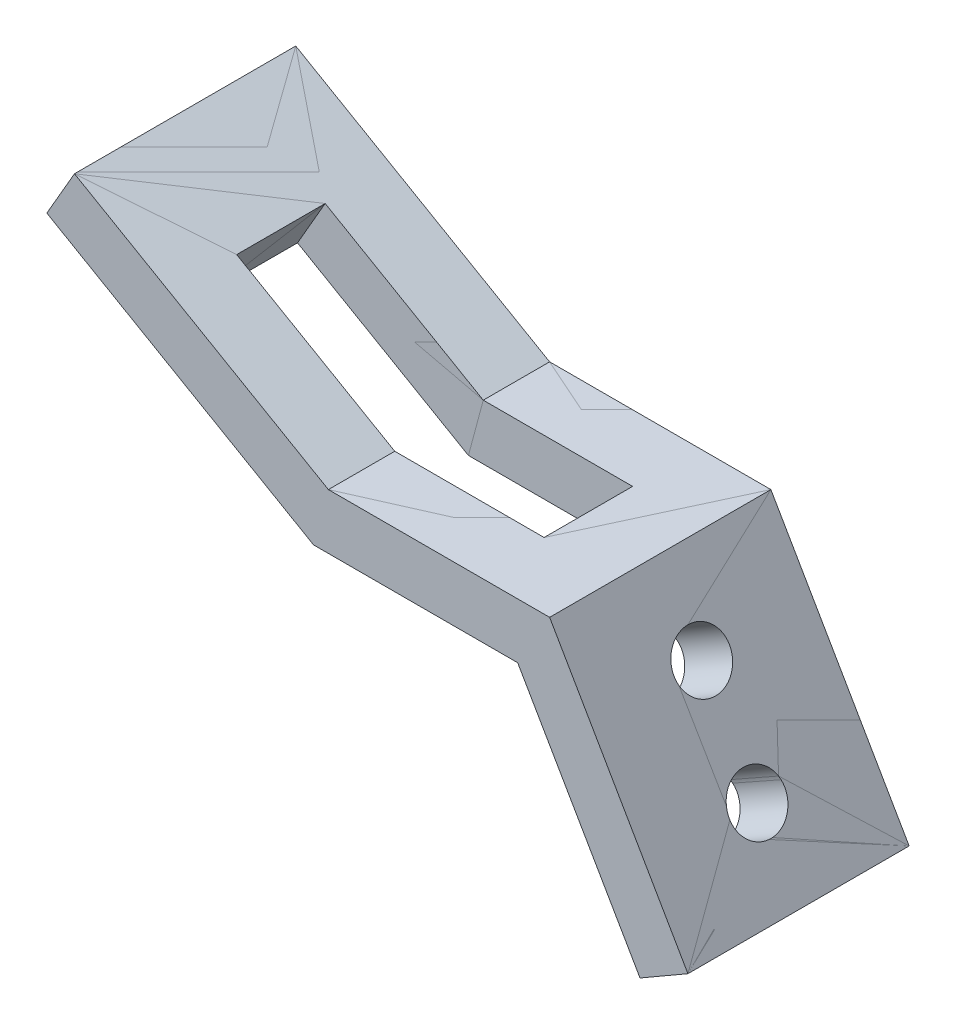
ISO-10303-21;
HEADER;
FILE_DESCRIPTION(('STEP AP214'),'2;1');
FILE_NAME('part.step','',(''),(''),'','','');
FILE_SCHEMA(('AUTOMOTIVE_DESIGN { 1 0 10303 214 1 1 1 1 }'));
ENDSEC;
DATA;
#1=APPLICATION_CONTEXT('core data for automotive mechanical design processes');
#2=APPLICATION_PROTOCOL_DEFINITION('international standard','automotive_design',2000,#1);
#3=PRODUCT_CONTEXT('',#1,'mechanical');
#4=PRODUCT('Part','Part','',(#3));
#5=PRODUCT_RELATED_PRODUCT_CATEGORY('part','',(#4));
#6=PRODUCT_DEFINITION_FORMATION('','',#4);
#7=PRODUCT_DEFINITION_CONTEXT('part definition',#1,'design');
#8=PRODUCT_DEFINITION('design','',#6,#7);
#9=PRODUCT_DEFINITION_SHAPE('','',#8);
#10=(LENGTH_UNIT() NAMED_UNIT(*) SI_UNIT(.MILLI.,.METRE.));
#11=(NAMED_UNIT(*) PLANE_ANGLE_UNIT() SI_UNIT($,.RADIAN.));
#12=(NAMED_UNIT(*) SI_UNIT($,.STERADIAN.) SOLID_ANGLE_UNIT());
#13=UNCERTAINTY_MEASURE_WITH_UNIT(LENGTH_MEASURE(1.E-05),#10,'distance_accuracy_value','');
#14=(GEOMETRIC_REPRESENTATION_CONTEXT(3) GLOBAL_UNCERTAINTY_ASSIGNED_CONTEXT((#13)) GLOBAL_UNIT_ASSIGNED_CONTEXT((#10,
#11,#12)) REPRESENTATION_CONTEXT('',''));
#15=CARTESIAN_POINT('',(0.,0.,0.));
#16=DIRECTION('',(0.,0.,1.));
#17=DIRECTION('',(1.,0.,0.));
#18=AXIS2_PLACEMENT_3D('',#15,#16,#17);
#19=CARTESIAN_POINT('',(2.32050807568877,-1.33974596215561,20.));
#20=DIRECTION('',(-0.5,-0.866025403784439,0.));
#21=DIRECTION('',(0.866025403784439,-0.5,0.));
#22=AXIS2_PLACEMENT_3D('',#19,#20,#21);
#23=PLANE('',#22);
#24=DIRECTION('',(0.,0.,1.));
#25=VECTOR('',#24,1.);
#26=CARTESIAN_POINT('',(-28.5788383248865,16.5,-8.));
#27=LINE('',#26,#25);
#28=CARTESIAN_POINT('',(-28.5788383248865,16.5,-8.));
#29=VERTEX_POINT('',#28);
#30=CARTESIAN_POINT('',(-28.5788383248865,16.5,8.));
#31=VERTEX_POINT('',#30);
#32=EDGE_CURVE('E206',#29,#31,#27,.T.);
#33=ORIENTED_EDGE('',*,*,#32,.F.);
#34=DIRECTION('',(-0.866025403784439,0.5,0.));
#35=VECTOR('',#34,1.);
#36=CARTESIAN_POINT('',(-28.5788383248865,16.5,-8.));
#37=LINE('',#36,#35);
#38=CARTESIAN_POINT('',(0.,0.,-8.));
#39=VERTEX_POINT('',#38);
#40=EDGE_CURVE('E212',#39,#29,#37,.T.);
#41=ORIENTED_EDGE('',*,*,#40,.F.);
#42=DIRECTION('',(0.,0.,-1.));
#43=VECTOR('',#42,1.);
#44=CARTESIAN_POINT('',(0.,0.,20.));
#45=LINE('',#44,#43);
#46=CARTESIAN_POINT('',(0.,0.,-20.));
#47=VERTEX_POINT('',#46);
#48=EDGE_CURVE('E253',#39,#47,#45,.T.);
#49=ORIENTED_EDGE('',*,*,#48,.T.);
#50=DIRECTION('',(-0.866025403784439,0.5,0.));
#51=VECTOR('',#50,1.);
#52=CARTESIAN_POINT('',(2.32050807568877,-1.33974596215561,-20.));
#53=LINE('',#52,#51);
#54=CARTESIAN_POINT('',(-45.8993464005753,26.5,-20.));
#55=VERTEX_POINT('',#54);
#56=EDGE_CURVE('E254',#47,#55,#53,.T.);
#57=ORIENTED_EDGE('',*,*,#56,.T.);
#58=DIRECTION('',(0.,0.,-1.));
#59=VECTOR('',#58,1.);
#60=CARTESIAN_POINT('',(-45.8993464005753,26.5,20.));
#61=LINE('',#60,#59);
#62=CARTESIAN_POINT('',(-45.8993464005753,26.5,20.));
#63=VERTEX_POINT('',#62);
#64=EDGE_CURVE('E13',#63,#55,#61,.T.);
#65=ORIENTED_EDGE('',*,*,#64,.F.);
#66=DIRECTION('',(-0.866025403784439,0.5,0.));
#67=VECTOR('',#66,1.);
#68=CARTESIAN_POINT('',(2.32050807568877,-1.33974596215561,20.));
#69=LINE('',#68,#67);
#70=CARTESIAN_POINT('',(0.,0.,20.));
#71=VERTEX_POINT('',#70);
#72=EDGE_CURVE('E231',#71,#63,#69,.T.);
#73=ORIENTED_EDGE('',*,*,#72,.F.);
#74=CARTESIAN_POINT('',(0.,0.,8.));
#75=VERTEX_POINT('',#74);
#76=EDGE_CURVE('E277',#71,#75,#45,.T.);
#77=ORIENTED_EDGE('',*,*,#76,.T.);
#78=DIRECTION('',(-0.866025403784439,0.5,0.));
#79=VECTOR('',#78,1.);
#80=CARTESIAN_POINT('',(-28.5788383248865,16.5,8.));
#81=LINE('',#80,#79);
#82=EDGE_CURVE('E123',#75,#31,#81,.T.);
#83=ORIENTED_EDGE('',*,*,#82,.T.);
#84=EDGE_LOOP('',(#33,#41,#49,#57,#65,#73,#77,#83));
#85=FACE_BOUND('',#84,.T.);
#86=ADVANCED_FACE('F103',(#85),#23,.F.);
#87=CARTESIAN_POINT('',(-50.8993464005753,17.8397459621556,20.));
#88=DIRECTION('',(-0.866025403784439,0.5,0.));
#89=DIRECTION('',(-0.5,-0.866025403784439,0.));
#90=AXIS2_PLACEMENT_3D('',#87,#88,#89);
#91=PLANE('',#90);
#92=DIRECTION('',(0.5,0.866025403784439,0.));
#93=VECTOR('',#92,1.);
#94=CARTESIAN_POINT('',(-50.8993464005753,17.8397459621556,-20.));
#95=LINE('',#94,#93);
#96=CARTESIAN_POINT('',(-50.8993464005753,17.8397459621556,-20.));
#97=VERTEX_POINT('',#96);
#98=EDGE_CURVE('E257',#97,#55,#95,.T.);
#99=ORIENTED_EDGE('',*,*,#98,.F.);
#100=DIRECTION('',(0.,0.,-1.));
#101=VECTOR('',#100,1.);
#102=CARTESIAN_POINT('',(-50.8993464005753,17.8397459621556,20.));
#103=LINE('',#102,#101);
#104=CARTESIAN_POINT('',(-50.8993464005753,17.8397459621556,20.));
#105=VERTEX_POINT('',#104);
#106=EDGE_CURVE('E110',#105,#97,#103,.T.);
#107=ORIENTED_EDGE('',*,*,#106,.F.);
#108=DIRECTION('',(0.5,0.866025403784439,0.));
#109=VECTOR('',#108,1.);
#110=CARTESIAN_POINT('',(-50.8993464005753,17.8397459621556,20.));
#111=LINE('',#110,#109);
#112=EDGE_CURVE('E233',#105,#63,#111,.T.);
#113=ORIENTED_EDGE('',*,*,#112,.T.);
#114=ORIENTED_EDGE('',*,*,#64,.T.);
#115=EDGE_LOOP('',(#99,#107,#113,#114));
#116=FACE_BOUND('',#115,.T.);
#117=ADVANCED_FACE('F299',(#116),#91,.T.);
#118=CARTESIAN_POINT('',(-2.67949192431123,-10.,20.));
#119=DIRECTION('',(-0.5,-0.866025403784439,0.));
#120=DIRECTION('',(0.866025403784439,-0.5,0.));
#121=AXIS2_PLACEMENT_3D('',#118,#119,#120);
#122=PLANE('',#121);
#123=DIRECTION('',(0.866025403784439,-0.5,0.));
#124=VECTOR('',#123,1.);
#125=CARTESIAN_POINT('',(-2.67949192431123,-10.,-8.));
#126=LINE('',#125,#124);
#127=CARTESIAN_POINT('',(-33.5788383248865,7.83974596215562,-8.));
#128=VERTEX_POINT('',#127);
#129=CARTESIAN_POINT('',(-2.67949192431123,-10.,-8.));
#130=VERTEX_POINT('',#129);
#131=EDGE_CURVE('E211',#128,#130,#126,.T.);
#132=ORIENTED_EDGE('',*,*,#131,.F.);
#133=DIRECTION('',(0.,0.,1.));
#134=VECTOR('',#133,1.);
#135=CARTESIAN_POINT('',(-33.5788383248865,7.83974596215562,-8.));
#136=LINE('',#135,#134);
#137=CARTESIAN_POINT('',(-33.5788383248865,7.83974596215562,8.));
#138=VERTEX_POINT('',#137);
#139=EDGE_CURVE('E208',#128,#138,#136,.T.);
#140=ORIENTED_EDGE('',*,*,#139,.T.);
#141=DIRECTION('',(0.866025403784439,-0.5,0.));
#142=VECTOR('',#141,1.);
#143=CARTESIAN_POINT('',(-2.67949192431123,-10.,8.));
#144=LINE('',#143,#142);
#145=CARTESIAN_POINT('',(-2.67949192431123,-10.,8.));
#146=VERTEX_POINT('',#145);
#147=EDGE_CURVE('E322',#138,#146,#144,.T.);
#148=ORIENTED_EDGE('',*,*,#147,.T.);
#149=DIRECTION('',(0.,0.,-1.));
#150=VECTOR('',#149,1.);
#151=CARTESIAN_POINT('',(-2.67949192431123,-10.,20.));
#152=LINE('',#151,#150);
#153=CARTESIAN_POINT('',(-2.67949192431123,-10.,20.));
#154=VERTEX_POINT('',#153);
#155=EDGE_CURVE('E289',#154,#146,#152,.T.);
#156=ORIENTED_EDGE('',*,*,#155,.F.);
#157=DIRECTION('',(-0.866025403784438,0.5,0.));
#158=VECTOR('',#157,1.);
#159=CARTESIAN_POINT('',(-2.67949192431123,-10.,20.));
#160=LINE('',#159,#158);
#161=EDGE_CURVE('E237',#154,#105,#160,.T.);
#162=ORIENTED_EDGE('',*,*,#161,.T.);
#163=ORIENTED_EDGE('',*,*,#106,.T.);
#164=DIRECTION('',(-0.866025403784438,0.5,0.));
#165=VECTOR('',#164,1.);
#166=CARTESIAN_POINT('',(-2.67949192431123,-10.,-20.));
#167=LINE('',#166,#165);
#168=CARTESIAN_POINT('',(-2.67949192431123,-10.,-20.));
#169=VERTEX_POINT('',#168);
#170=EDGE_CURVE('E261',#169,#97,#167,.T.);
#171=ORIENTED_EDGE('',*,*,#170,.F.);
#172=EDGE_CURVE('E288',#130,#169,#152,.T.);
#173=ORIENTED_EDGE('',*,*,#172,.F.);
#174=EDGE_LOOP('',(#132,#140,#148,#156,#162,#163,#171,#173));
#175=FACE_BOUND('',#174,.T.);
#176=ADVANCED_FACE('F294',(#175),#122,.T.);
#177=CARTESIAN_POINT('',(-2.67949192431123,-10.,20.));
#178=DIRECTION('',(0.,-1.,0.));
#179=DIRECTION('',(0.,0.,-1.));
#180=AXIS2_PLACEMENT_3D('',#177,#178,#179);
#181=PLANE('',#180);
#182=DIRECTION('',(1.,0.,0.));
#183=VECTOR('',#182,1.);
#184=CARTESIAN_POINT('',(27.,-10.,-8.));
#185=LINE('',#184,#183);
#186=CARTESIAN_POINT('',(27.,-10.,-8.));
#187=VERTEX_POINT('',#186);
#188=EDGE_CURVE('E312',#130,#187,#185,.T.);
#189=ORIENTED_EDGE('',*,*,#188,.F.);
#190=ORIENTED_EDGE('',*,*,#172,.T.);
#191=DIRECTION('',(-1.,0.,0.));
#192=VECTOR('',#191,1.);
#193=CARTESIAN_POINT('',(-2.67949192431123,-10.,-20.));
#194=LINE('',#193,#192);
#195=CARTESIAN_POINT('',(34.2264973081037,-10.,-20.));
#196=VERTEX_POINT('',#195);
#197=EDGE_CURVE('E264',#196,#169,#194,.T.);
#198=ORIENTED_EDGE('',*,*,#197,.F.);
#199=DIRECTION('',(0.,0.,-1.));
#200=VECTOR('',#199,1.);
#201=CARTESIAN_POINT('',(34.2264973081037,-10.,20.));
#202=LINE('',#201,#200);
#203=CARTESIAN_POINT('',(34.2264973081037,-10.,20.));
#204=VERTEX_POINT('',#203);
#205=EDGE_CURVE('E286',#204,#196,#202,.T.);
#206=ORIENTED_EDGE('',*,*,#205,.F.);
#207=DIRECTION('',(-1.,0.,0.));
#208=VECTOR('',#207,1.);
#209=CARTESIAN_POINT('',(-2.67949192431123,-10.,20.));
#210=LINE('',#209,#208);
#211=EDGE_CURVE('E240',#204,#154,#210,.T.);
#212=ORIENTED_EDGE('',*,*,#211,.T.);
#213=ORIENTED_EDGE('',*,*,#155,.T.);
#214=DIRECTION('',(1.,0.,0.));
#215=VECTOR('',#214,1.);
#216=CARTESIAN_POINT('',(27.,-10.,8.));
#217=LINE('',#216,#215);
#218=CARTESIAN_POINT('',(27.,-10.,8.));
#219=VERTEX_POINT('',#218);
#220=EDGE_CURVE('E324',#146,#219,#217,.T.);
#221=ORIENTED_EDGE('',*,*,#220,.T.);
#222=DIRECTION('',(0.,0.,1.));
#223=VECTOR('',#222,1.);
#224=CARTESIAN_POINT('',(27.,-10.,-8.));
#225=LINE('',#224,#223);
#226=EDGE_CURVE('E225',#187,#219,#225,.T.);
#227=ORIENTED_EDGE('',*,*,#226,.F.);
#228=EDGE_LOOP('',(#189,#190,#198,#206,#212,#213,#221,#227));
#229=FACE_BOUND('',#228,.T.);
#230=ADVANCED_FACE('F308',(#229),#181,.T.);
#231=CARTESIAN_POINT('',(34.2264973081037,-10.,20.));
#232=DIRECTION('',(-0.866025403784439,-0.5,0.));
#233=DIRECTION('',(0.5,-0.866025403784439,0.));
#234=AXIS2_PLACEMENT_3D('',#231,#232,#233);
#235=PLANE('',#234);
#236=CARTESIAN_POINT('',(38.8397459621556,-17.9903810567666,0.));
#237=DIRECTION('',(-0.866025403784439,-0.5,0.));
#238=DIRECTION('',(0.5,-0.866025403784439,0.));
#239=AXIS2_PLACEMENT_3D('',#236,#237,#238);
#240=CIRCLE('',#239,5.);
#241=CARTESIAN_POINT('',(41.3397459621556,-22.3205080756888,0.));
#242=VERTEX_POINT('',#241);
#243=EDGE_CURVE('E320',#242,#242,#240,.T.);
#244=ORIENTED_EDGE('',*,*,#243,.F.);
#245=EDGE_LOOP('',(#244));
#246=FACE_BOUND('',#245,.T.);
#247=CARTESIAN_POINT('',(48.8397459621556,-35.3108891324554,0.));
#248=DIRECTION('',(-0.866025403784439,-0.5,0.));
#249=DIRECTION('',(0.5,-0.866025403784439,0.));
#250=AXIS2_PLACEMENT_3D('',#247,#248,#249);
#251=CIRCLE('',#250,5.);
#252=CARTESIAN_POINT('',(51.3397459621556,-39.6410161513776,0.));
#253=VERTEX_POINT('',#252);
#254=EDGE_CURVE('E492',#253,#253,#251,.T.);
#255=ORIENTED_EDGE('',*,*,#254,.F.);
#256=EDGE_LOOP('',(#255));
#257=FACE_BOUND('',#256,.T.);
#258=DIRECTION('',(-0.5,0.866025403784439,0.));
#259=VECTOR('',#258,1.);
#260=CARTESIAN_POINT('',(34.2264973081037,-10.,-20.));
#261=LINE('',#260,#259);
#262=CARTESIAN_POINT('',(56.3397459621556,-48.3012701892219,-20.));
#263=VERTEX_POINT('',#262);
#264=EDGE_CURVE('E267',#263,#196,#261,.T.);
#265=ORIENTED_EDGE('',*,*,#264,.F.);
#266=DIRECTION('',(0.,0.,-1.));
#267=VECTOR('',#266,1.);
#268=CARTESIAN_POINT('',(56.3397459621556,-48.3012701892219,20.));
#269=LINE('',#268,#267);
#270=CARTESIAN_POINT('',(56.3397459621556,-48.3012701892219,20.));
#271=VERTEX_POINT('',#270);
#272=EDGE_CURVE('E284',#271,#263,#269,.T.);
#273=ORIENTED_EDGE('',*,*,#272,.F.);
#274=DIRECTION('',(-0.5,0.866025403784439,0.));
#275=VECTOR('',#274,1.);
#276=CARTESIAN_POINT('',(34.2264973081037,-10.,20.));
#277=LINE('',#276,#275);
#278=EDGE_CURVE('E243',#271,#204,#277,.T.);
#279=ORIENTED_EDGE('',*,*,#278,.T.);
#280=ORIENTED_EDGE('',*,*,#205,.T.);
#281=EDGE_LOOP('',(#265,#273,#279,#280));
#282=FACE_BOUND('',#281,.T.);
#283=ADVANCED_FACE('F352',(#246,#257,#282),#235,.T.);
#284=CARTESIAN_POINT('',(65.,-43.3012701892219,20.));
#285=DIRECTION('',(0.499999999999999,-0.866025403784439,0.));
#286=DIRECTION('',(0.866025403784439,0.499999999999999,0.));
#287=AXIS2_PLACEMENT_3D('',#284,#285,#286);
#288=PLANE('',#287);
#289=DIRECTION('',(-0.866025403784439,-0.499999999999999,0.));
#290=VECTOR('',#289,1.);
#291=CARTESIAN_POINT('',(65.,-43.3012701892219,-20.));
#292=LINE('',#291,#290);
#293=CARTESIAN_POINT('',(65.,-43.3012701892219,-20.));
#294=VERTEX_POINT('',#293);
#295=EDGE_CURVE('E270',#294,#263,#292,.T.);
#296=ORIENTED_EDGE('',*,*,#295,.F.);
#297=DIRECTION('',(0.,0.,-1.));
#298=VECTOR('',#297,1.);
#299=CARTESIAN_POINT('',(65.,-43.3012701892219,20.));
#300=LINE('',#299,#298);
#301=CARTESIAN_POINT('',(65.,-43.3012701892219,20.));
#302=VERTEX_POINT('',#301);
#303=EDGE_CURVE('E282',#302,#294,#300,.T.);
#304=ORIENTED_EDGE('',*,*,#303,.F.);
#305=DIRECTION('',(-0.866025403784439,-0.499999999999999,0.));
#306=VECTOR('',#305,1.);
#307=CARTESIAN_POINT('',(65.,-43.3012701892219,20.));
#308=LINE('',#307,#306);
#309=EDGE_CURVE('E246',#302,#271,#308,.T.);
#310=ORIENTED_EDGE('',*,*,#309,.T.);
#311=ORIENTED_EDGE('',*,*,#272,.T.);
#312=EDGE_LOOP('',(#296,#304,#310,#311));
#313=FACE_BOUND('',#312,.T.);
#314=ADVANCED_FACE('F350',(#313),#288,.T.);
#315=CARTESIAN_POINT('',(42.8867513459481,-5.,20.));
#316=DIRECTION('',(-0.866025403784439,-0.5,0.));
#317=DIRECTION('',(0.5,-0.866025403784439,0.));
#318=AXIS2_PLACEMENT_3D('',#315,#316,#317);
#319=PLANE('',#318);
#320=CARTESIAN_POINT('',(47.5,-12.9903810567666,0.));
#321=DIRECTION('',(0.866025403784438,0.500000000000002,0.));
#322=DIRECTION('',(-0.500000000000001,0.866025403784438,0.));
#323=AXIS2_PLACEMENT_3D('',#320,#321,#322);
#324=CIRCLE('',#323,5.);
#325=CARTESIAN_POINT('',(45.,-8.66025403784441,0.));
#326=VERTEX_POINT('',#325);
#327=EDGE_CURVE('E491',#326,#326,#324,.T.);
#328=ORIENTED_EDGE('',*,*,#327,.F.);
#329=EDGE_LOOP('',(#328));
#330=FACE_BOUND('',#329,.T.);
#331=CARTESIAN_POINT('',(57.5000000000001,-30.3108891324554,0.));
#332=DIRECTION('',(0.866025403784438,0.500000000000002,0.));
#333=DIRECTION('',(-0.500000000000001,0.866025403784438,0.));
#334=AXIS2_PLACEMENT_3D('',#331,#332,#333);
#335=CIRCLE('',#334,5.);
#336=CARTESIAN_POINT('',(55.,-25.9807621135332,0.));
#337=VERTEX_POINT('',#336);
#338=EDGE_CURVE('E493',#337,#337,#335,.T.);
#339=ORIENTED_EDGE('',*,*,#338,.F.);
#340=EDGE_LOOP('',(#339));
#341=FACE_BOUND('',#340,.T.);
#342=DIRECTION('',(-0.5,0.866025403784439,0.));
#343=VECTOR('',#342,1.);
#344=CARTESIAN_POINT('',(42.8867513459481,-5.,-20.));
#345=LINE('',#344,#343);
#346=CARTESIAN_POINT('',(40.,0.,-20.));
#347=VERTEX_POINT('',#346);
#348=EDGE_CURVE('E273',#294,#347,#345,.T.);
#349=ORIENTED_EDGE('',*,*,#348,.T.);
#350=DIRECTION('',(0.,0.,-1.));
#351=VECTOR('',#350,1.);
#352=CARTESIAN_POINT('',(40.,0.,20.));
#353=LINE('',#352,#351);
#354=CARTESIAN_POINT('',(40.,0.,20.));
#355=VERTEX_POINT('',#354);
#356=EDGE_CURVE('E279',#355,#347,#353,.T.);
#357=ORIENTED_EDGE('',*,*,#356,.F.);
#358=DIRECTION('',(-0.5,0.866025403784439,0.));
#359=VECTOR('',#358,1.);
#360=CARTESIAN_POINT('',(42.8867513459481,-5.,20.));
#361=LINE('',#360,#359);
#362=EDGE_CURVE('E249',#302,#355,#361,.T.);
#363=ORIENTED_EDGE('',*,*,#362,.F.);
#364=ORIENTED_EDGE('',*,*,#303,.T.);
#365=EDGE_LOOP('',(#349,#357,#363,#364));
#366=FACE_BOUND('',#365,.T.);
#367=ADVANCED_FACE('F347',(#330,#341,#366),#319,.F.);
#368=CARTESIAN_POINT('',(-2.67949192431123,0.,20.));
#369=DIRECTION('',(0.,-1.,0.));
#370=DIRECTION('',(0.,0.,-1.));
#371=AXIS2_PLACEMENT_3D('',#368,#369,#370);
#372=PLANE('',#371);
#373=ORIENTED_EDGE('',*,*,#48,.F.);
#374=DIRECTION('',(-1.,0.,0.));
#375=VECTOR('',#374,1.);
#376=CARTESIAN_POINT('',(0.,0.,-8.));
#377=LINE('',#376,#375);
#378=CARTESIAN_POINT('',(27.,0.,-8.));
#379=VERTEX_POINT('',#378);
#380=EDGE_CURVE('E218',#379,#39,#377,.T.);
#381=ORIENTED_EDGE('',*,*,#380,.F.);
#382=DIRECTION('',(0.,0.,1.));
#383=VECTOR('',#382,1.);
#384=CARTESIAN_POINT('',(27.,0.,-8.));
#385=LINE('',#384,#383);
#386=CARTESIAN_POINT('',(27.,0.,8.));
#387=VERTEX_POINT('',#386);
#388=EDGE_CURVE('E258',#379,#387,#385,.T.);
#389=ORIENTED_EDGE('',*,*,#388,.T.);
#390=DIRECTION('',(-1.,0.,0.));
#391=VECTOR('',#390,1.);
#392=CARTESIAN_POINT('',(0.,0.,8.));
#393=LINE('',#392,#391);
#394=EDGE_CURVE('E221',#387,#75,#393,.T.);
#395=ORIENTED_EDGE('',*,*,#394,.T.);
#396=ORIENTED_EDGE('',*,*,#76,.F.);
#397=DIRECTION('',(1.,0.,0.));
#398=VECTOR('',#397,1.);
#399=CARTESIAN_POINT('',(-2.67949192431123,0.,20.));
#400=LINE('',#399,#398);
#401=EDGE_CURVE('E251',#355,#71,#400,.F.);
#402=ORIENTED_EDGE('',*,*,#401,.F.);
#403=ORIENTED_EDGE('',*,*,#356,.T.);
#404=DIRECTION('',(1.,0.,0.));
#405=VECTOR('',#404,1.);
#406=CARTESIAN_POINT('',(-2.67949192431123,0.,-20.));
#407=LINE('',#406,#405);
#408=EDGE_CURVE('E234',#347,#47,#407,.F.);
#409=ORIENTED_EDGE('',*,*,#408,.T.);
#410=EDGE_LOOP('',(#373,#381,#389,#395,#396,#402,#403,#409));
#411=FACE_BOUND('',#410,.T.);
#412=ADVANCED_FACE('F343',(#411),#372,.F.);
#413=CARTESIAN_POINT('',(0.,0.,20.));
#414=DIRECTION('',(0.,0.,-1.));
#415=DIRECTION('',(-1.,0.,0.));
#416=AXIS2_PLACEMENT_3D('',#413,#414,#415);
#417=PLANE('',#416);
#418=ORIENTED_EDGE('',*,*,#72,.T.);
#419=ORIENTED_EDGE('',*,*,#112,.F.);
#420=ORIENTED_EDGE('',*,*,#161,.F.);
#421=ORIENTED_EDGE('',*,*,#211,.F.);
#422=ORIENTED_EDGE('',*,*,#278,.F.);
#423=ORIENTED_EDGE('',*,*,#309,.F.);
#424=ORIENTED_EDGE('',*,*,#362,.T.);
#425=ORIENTED_EDGE('',*,*,#401,.T.);
#426=EDGE_LOOP('',(#418,#419,#420,#421,#422,#423,#424,#425));
#427=FACE_BOUND('',#426,.T.);
#428=ADVANCED_FACE('F334',(#427),#417,.F.);
#429=CARTESIAN_POINT('',(0.,0.,-20.));
#430=DIRECTION('',(0.,0.,-1.));
#431=DIRECTION('',(-1.,0.,0.));
#432=AXIS2_PLACEMENT_3D('',#429,#430,#431);
#433=PLANE('',#432);
#434=ORIENTED_EDGE('',*,*,#56,.F.);
#435=ORIENTED_EDGE('',*,*,#408,.F.);
#436=ORIENTED_EDGE('',*,*,#348,.F.);
#437=ORIENTED_EDGE('',*,*,#295,.T.);
#438=ORIENTED_EDGE('',*,*,#264,.T.);
#439=ORIENTED_EDGE('',*,*,#197,.T.);
#440=ORIENTED_EDGE('',*,*,#170,.T.);
#441=ORIENTED_EDGE('',*,*,#98,.T.);
#442=EDGE_LOOP('',(#434,#435,#436,#437,#438,#439,#440,#441));
#443=FACE_BOUND('',#442,.T.);
#444=ADVANCED_FACE('F303',(#443),#433,.T.);
#445=CARTESIAN_POINT('',(27.,0.,-8.));
#446=DIRECTION('',(1.,0.,0.));
#447=DIRECTION('',(0.,0.,-1.));
#448=AXIS2_PLACEMENT_3D('',#445,#446,#447);
#449=PLANE('',#448);
#450=DIRECTION('',(0.,1.,0.));
#451=VECTOR('',#450,1.);
#452=CARTESIAN_POINT('',(27.,0.,8.));
#453=LINE('',#452,#451);
#454=EDGE_CURVE('E117',#219,#387,#453,.T.);
#455=ORIENTED_EDGE('',*,*,#454,.T.);
#456=ORIENTED_EDGE('',*,*,#388,.F.);
#457=DIRECTION('',(0.,1.,0.));
#458=VECTOR('',#457,1.);
#459=CARTESIAN_POINT('',(27.,0.,-8.));
#460=LINE('',#459,#458);
#461=EDGE_CURVE('E227',#187,#379,#460,.T.);
#462=ORIENTED_EDGE('',*,*,#461,.F.);
#463=ORIENTED_EDGE('',*,*,#226,.T.);
#464=EDGE_LOOP('',(#455,#456,#462,#463));
#465=FACE_BOUND('',#464,.T.);
#466=ADVANCED_FACE('F331',(#465),#449,.F.);
#467=CARTESIAN_POINT('',(-28.5788383248865,16.5,-8.));
#468=DIRECTION('',(-0.866025403784439,0.5,0.));
#469=DIRECTION('',(-0.5,-0.866025403784439,0.));
#470=AXIS2_PLACEMENT_3D('',#467,#468,#469);
#471=PLANE('',#470);
#472=DIRECTION('',(-0.5,-0.866025403784439,0.));
#473=VECTOR('',#472,1.);
#474=CARTESIAN_POINT('',(-28.5788383248865,16.5,8.));
#475=LINE('',#474,#473);
#476=EDGE_CURVE('E319',#31,#138,#475,.T.);
#477=ORIENTED_EDGE('',*,*,#476,.T.);
#478=ORIENTED_EDGE('',*,*,#139,.F.);
#479=DIRECTION('',(-0.5,-0.866025403784439,0.));
#480=VECTOR('',#479,1.);
#481=CARTESIAN_POINT('',(-28.5788383248865,16.5,-8.));
#482=LINE('',#481,#480);
#483=EDGE_CURVE('E201',#29,#128,#482,.T.);
#484=ORIENTED_EDGE('',*,*,#483,.F.);
#485=ORIENTED_EDGE('',*,*,#32,.T.);
#486=EDGE_LOOP('',(#477,#478,#484,#485));
#487=FACE_BOUND('',#486,.T.);
#488=ADVANCED_FACE('F204',(#487),#471,.F.);
#489=CARTESIAN_POINT('',(0.,0.,-8.));
#490=DIRECTION('',(0.,0.,-1.));
#491=DIRECTION('',(-1.,0.,0.));
#492=AXIS2_PLACEMENT_3D('',#489,#490,#491);
#493=PLANE('',#492);
#494=ORIENTED_EDGE('',*,*,#40,.T.);
#495=ORIENTED_EDGE('',*,*,#483,.T.);
#496=ORIENTED_EDGE('',*,*,#131,.T.);
#497=ORIENTED_EDGE('',*,*,#188,.T.);
#498=ORIENTED_EDGE('',*,*,#461,.T.);
#499=ORIENTED_EDGE('',*,*,#380,.T.);
#500=EDGE_LOOP('',(#494,#495,#496,#497,#498,#499));
#501=FACE_BOUND('',#500,.T.);
#502=ADVANCED_FACE('F215',(#501),#493,.F.);
#503=CARTESIAN_POINT('',(0.,0.,8.));
#504=DIRECTION('',(0.,0.,-1.));
#505=DIRECTION('',(-1.,0.,0.));
#506=AXIS2_PLACEMENT_3D('',#503,#504,#505);
#507=PLANE('',#506);
#508=ORIENTED_EDGE('',*,*,#82,.F.);
#509=ORIENTED_EDGE('',*,*,#394,.F.);
#510=ORIENTED_EDGE('',*,*,#454,.F.);
#511=ORIENTED_EDGE('',*,*,#220,.F.);
#512=ORIENTED_EDGE('',*,*,#147,.F.);
#513=ORIENTED_EDGE('',*,*,#476,.F.);
#514=EDGE_LOOP('',(#508,#509,#510,#511,#512,#513));
#515=FACE_BOUND('',#514,.T.);
#516=ADVANCED_FACE('F332',(#515),#507,.T.);
#517=CARTESIAN_POINT('',(-31.5895733098924,-81.7467782649109,0.));
#518=DIRECTION('',(0.866025403784438,0.500000000000001,0.));
#519=DIRECTION('',(-0.500000000000002,0.866025403784438,0.));
#520=AXIS2_PLACEMENT_3D('',#517,#518,#519);
#521=CYLINDRICAL_SURFACE('',#520,5.);
#522=ORIENTED_EDGE('',*,*,#254,.T.);
#523=EDGE_LOOP('',(#522));
#524=FACE_BOUND('',#523,.T.);
#525=ORIENTED_EDGE('',*,*,#338,.T.);
#526=EDGE_LOOP('',(#525));
#527=FACE_BOUND('',#526,.T.);
#528=ADVANCED_FACE('F425',(#524,#527),#521,.F.);
#529=CARTESIAN_POINT('',(-41.5895733098924,-64.4262701892221,0.));
#530=DIRECTION('',(0.866025403784438,0.500000000000001,0.));
#531=DIRECTION('',(-0.500000000000002,0.866025403784438,0.));
#532=AXIS2_PLACEMENT_3D('',#529,#530,#531);
#533=CYLINDRICAL_SURFACE('',#532,5.);
#534=ORIENTED_EDGE('',*,*,#243,.T.);
#535=EDGE_LOOP('',(#534));
#536=FACE_BOUND('',#535,.T.);
#537=ORIENTED_EDGE('',*,*,#327,.T.);
#538=EDGE_LOOP('',(#537));
#539=FACE_BOUND('',#538,.T.);
#540=ADVANCED_FACE('F446',(#536,#539),#533,.F.);
#541=CLOSED_SHELL('',(#86,#117,#176,#230,#283,#314,#367,#412,#428,#444,#466,#488,#502,#516,#528,#540));
#542=MANIFOLD_SOLID_BREP('B2',#541);
#543=CARTESIAN_POINT('',(56.3397459621557,-48.3012701892219,20.));
#544=DIRECTION('',(-0.866025403784437,-0.500000000000002,0.));
#545=DIRECTION('',(0.500000000000002,-0.866025403784437,0.));
#546=AXIS2_PLACEMENT_3D('',#543,#544,#545);
#547=PLANE('',#546);
#548=CARTESIAN_POINT('',(38.8397459621556,-17.9903810567666,0.));
#549=DIRECTION('',(-0.866025403784437,-0.500000000000002,0.));
#550=DIRECTION('',(0.500000000000002,-0.866025403784437,0.));
#551=AXIS2_PLACEMENT_3D('',#548,#549,#550);
#552=CIRCLE('',#551,5.);
#553=CARTESIAN_POINT('',(41.3397459621557,-22.3205080756888,0.));
#554=VERTEX_POINT('',#553);
#555=EDGE_CURVE('E789',#554,#554,#552,.T.);
#556=ORIENTED_EDGE('',*,*,#555,.F.);
#557=EDGE_LOOP('',(#556));
#558=FACE_BOUND('',#557,.T.);
#559=CARTESIAN_POINT('',(48.8397459621557,-35.3108891324554,0.));
#560=DIRECTION('',(-0.866025403784437,-0.500000000000002,0.));
#561=DIRECTION('',(0.500000000000002,-0.866025403784437,0.));
#562=AXIS2_PLACEMENT_3D('',#559,#560,#561);
#563=CIRCLE('',#562,5.);
#564=CARTESIAN_POINT('',(51.3397459621557,-39.6410161513776,0.));
#565=VERTEX_POINT('',#564);
#566=EDGE_CURVE('E800',#565,#565,#563,.T.);
#567=ORIENTED_EDGE('',*,*,#566,.F.);
#568=EDGE_LOOP('',(#567));
#569=FACE_BOUND('',#568,.T.);
#570=DIRECTION('',(-0.500000000000002,0.866025403784437,0.));
#571=VECTOR('',#570,1.);
#572=CARTESIAN_POINT('',(56.3397459621557,-48.3012701892219,-20.));
#573=LINE('',#572,#571);
#574=CARTESIAN_POINT('',(56.3397459621557,-48.3012701892219,-20.));
#575=VERTEX_POINT('',#574);
#576=CARTESIAN_POINT('',(34.2264973081038,-10.,-20.));
#577=VERTEX_POINT('',#576);
#578=EDGE_CURVE('E674',#575,#577,#573,.T.);
#579=ORIENTED_EDGE('',*,*,#578,.F.);
#580=DIRECTION('',(0.,0.,-1.));
#581=VECTOR('',#580,1.);
#582=CARTESIAN_POINT('',(56.3397459621557,-48.3012701892219,20.));
#583=LINE('',#582,#581);
#584=CARTESIAN_POINT('',(56.3397459621557,-48.3012701892219,20.));
#585=VERTEX_POINT('',#584);
#586=EDGE_CURVE('E101',#585,#575,#583,.T.);
#587=ORIENTED_EDGE('',*,*,#586,.F.);
#588=DIRECTION('',(0.500000000000001,-0.866025403784438,0.));
#589=VECTOR('',#588,1.);
#590=CARTESIAN_POINT('',(31.3397459621556,-5.00000000000002,20.));
#591=LINE('',#590,#589);
#592=CARTESIAN_POINT('',(34.2264973081038,-10.,20.));
#593=VERTEX_POINT('',#592);
#594=EDGE_CURVE('E642',#593,#585,#591,.T.);
#595=ORIENTED_EDGE('',*,*,#594,.F.);
#596=DIRECTION('',(0.,0.,-1.));
#597=VECTOR('',#596,1.);
#598=CARTESIAN_POINT('',(34.2264973081038,-10.,20.));
#599=LINE('',#598,#597);
#600=EDGE_CURVE('E673',#593,#577,#599,.T.);
#601=ORIENTED_EDGE('',*,*,#600,.T.);
#602=EDGE_LOOP('',(#579,#587,#595,#601));
#603=FACE_BOUND('',#602,.T.);
#604=ADVANCED_FACE('F507',(#558,#569,#603),#547,.T.);
#605=CARTESIAN_POINT('',(65.0000000000001,-43.3012701892219,20.));
#606=DIRECTION('',(0.500000000000001,-0.866025403784438,0.));
#607=DIRECTION('',(0.866025403784438,0.500000000000001,0.));
#608=AXIS2_PLACEMENT_3D('',#605,#606,#607);
#609=PLANE('',#608);
#610=DIRECTION('',(-0.866025403784438,-0.500000000000001,0.));
#611=VECTOR('',#610,1.);
#612=CARTESIAN_POINT('',(65.0000000000001,-43.3012701892219,-20.));
#613=LINE('',#612,#611);
#614=CARTESIAN_POINT('',(65.0000000000001,-43.3012701892219,-20.));
#615=VERTEX_POINT('',#614);
#616=EDGE_CURVE('E677',#615,#575,#613,.T.);
#617=ORIENTED_EDGE('',*,*,#616,.F.);
#618=DIRECTION('',(0.,0.,-1.));
#619=VECTOR('',#618,1.);
#620=CARTESIAN_POINT('',(65.0000000000001,-43.3012701892219,20.));
#621=LINE('',#620,#619);
#622=CARTESIAN_POINT('',(65.0000000000001,-43.3012701892219,20.));
#623=VERTEX_POINT('',#622);
#624=EDGE_CURVE('E515',#623,#615,#621,.T.);
#625=ORIENTED_EDGE('',*,*,#624,.F.);
#626=DIRECTION('',(-0.866025403784438,-0.500000000000001,0.));
#627=VECTOR('',#626,1.);
#628=CARTESIAN_POINT('',(65.0000000000001,-43.3012701892219,20.));
#629=LINE('',#628,#627);
#630=EDGE_CURVE('E645',#623,#585,#629,.T.);
#631=ORIENTED_EDGE('',*,*,#630,.T.);
#632=ORIENTED_EDGE('',*,*,#586,.T.);
#633=EDGE_LOOP('',(#617,#625,#631,#632));
#634=FACE_BOUND('',#633,.T.);
#635=ADVANCED_FACE('F734',(#634),#609,.T.);
#636=CARTESIAN_POINT('',(40.,0.,20.));
#637=DIRECTION('',(0.866025403784438,0.500000000000001,0.));
#638=DIRECTION('',(-0.500000000000001,0.866025403784438,0.));
#639=AXIS2_PLACEMENT_3D('',#636,#637,#638);
#640=PLANE('',#639);
#641=CARTESIAN_POINT('',(47.5,-12.9903810567666,0.));
#642=DIRECTION('',(0.866025403784438,0.500000000000002,0.));
#643=DIRECTION('',(-0.500000000000001,0.866025403784438,0.));
#644=AXIS2_PLACEMENT_3D('',#641,#642,#643);
#645=CIRCLE('',#644,5.);
#646=CARTESIAN_POINT('',(45.,-8.66025403784441,0.));
#647=VERTEX_POINT('',#646);
#648=EDGE_CURVE('E804',#647,#647,#645,.T.);
#649=ORIENTED_EDGE('',*,*,#648,.F.);
#650=EDGE_LOOP('',(#649));
#651=FACE_BOUND('',#650,.T.);
#652=CARTESIAN_POINT('',(57.5000000000001,-30.3108891324554,0.));
#653=DIRECTION('',(0.866025403784438,0.500000000000002,0.));
#654=DIRECTION('',(-0.500000000000001,0.866025403784438,0.));
#655=AXIS2_PLACEMENT_3D('',#652,#653,#654);
#656=CIRCLE('',#655,5.);
#657=CARTESIAN_POINT('',(55.,-25.9807621135332,0.));
#658=VERTEX_POINT('',#657);
#659=EDGE_CURVE('E805',#658,#658,#656,.T.);
#660=ORIENTED_EDGE('',*,*,#659,.F.);
#661=EDGE_LOOP('',(#660));
#662=FACE_BOUND('',#661,.T.);
#663=DIRECTION('',(0.500000000000001,-0.866025403784438,0.));
#664=VECTOR('',#663,1.);
#665=CARTESIAN_POINT('',(40.,0.,-20.));
#666=LINE('',#665,#664);
#667=CARTESIAN_POINT('',(40.,0.,-20.));
#668=VERTEX_POINT('',#667);
#669=EDGE_CURVE('E682',#668,#615,#666,.T.);
#670=ORIENTED_EDGE('',*,*,#669,.F.);
#671=DIRECTION('',(0.,0.,-1.));
#672=VECTOR('',#671,1.);
#673=CARTESIAN_POINT('',(40.,0.,20.));
#674=LINE('',#673,#672);
#675=CARTESIAN_POINT('',(40.,0.,20.));
#676=VERTEX_POINT('',#675);
#677=EDGE_CURVE('E724',#676,#668,#674,.T.);
#678=ORIENTED_EDGE('',*,*,#677,.F.);
#679=DIRECTION('',(0.500000000000001,-0.866025403784438,0.));
#680=VECTOR('',#679,1.);
#681=CARTESIAN_POINT('',(40.,0.,20.));
#682=LINE('',#681,#680);
#683=EDGE_CURVE('E650',#676,#623,#682,.T.);
#684=ORIENTED_EDGE('',*,*,#683,.T.);
#685=ORIENTED_EDGE('',*,*,#624,.T.);
#686=EDGE_LOOP('',(#670,#678,#684,#685));
#687=FACE_BOUND('',#686,.T.);
#688=ADVANCED_FACE('F730',(#651,#662,#687),#640,.T.);
#689=CARTESIAN_POINT('',(0.,0.,20.));
#690=DIRECTION('',(0.,1.,0.));
#691=DIRECTION('',(0.,0.,1.));
#692=AXIS2_PLACEMENT_3D('',#689,#690,#691);
#693=PLANE('',#692);
#694=DIRECTION('',(-1.,0.,0.));
#695=VECTOR('',#694,1.);
#696=CARTESIAN_POINT('',(0.,0.,-8.));
#697=LINE('',#696,#695);
#698=CARTESIAN_POINT('',(27.,0.,-8.));
#699=VERTEX_POINT('',#698);
#700=CARTESIAN_POINT('',(0.,0.,-8.));
#701=VERTEX_POINT('',#700);
#702=EDGE_CURVE('E623',#699,#701,#697,.T.);
#703=ORIENTED_EDGE('',*,*,#702,.F.);
#704=DIRECTION('',(0.,0.,1.));
#705=VECTOR('',#704,1.);
#706=CARTESIAN_POINT('',(27.,0.,-8.));
#707=LINE('',#706,#705);
#708=CARTESIAN_POINT('',(27.,0.,8.));
#709=VERTEX_POINT('',#708);
#710=EDGE_CURVE('E678',#699,#709,#707,.T.);
#711=ORIENTED_EDGE('',*,*,#710,.T.);
#712=DIRECTION('',(-1.,0.,0.));
#713=VECTOR('',#712,1.);
#714=CARTESIAN_POINT('',(0.,0.,8.));
#715=LINE('',#714,#713);
#716=CARTESIAN_POINT('',(0.,0.,8.));
#717=VERTEX_POINT('',#716);
#718=EDGE_CURVE('E627',#709,#717,#715,.T.);
#719=ORIENTED_EDGE('',*,*,#718,.T.);
#720=DIRECTION('',(0.,0.,-1.));
#721=VECTOR('',#720,1.);
#722=CARTESIAN_POINT('',(0.,0.,20.));
#723=LINE('',#722,#721);
#724=CARTESIAN_POINT('',(0.,0.,20.));
#725=VERTEX_POINT('',#724);
#726=EDGE_CURVE('E721',#725,#717,#723,.T.);
#727=ORIENTED_EDGE('',*,*,#726,.F.);
#728=DIRECTION('',(1.,0.,0.));
#729=VECTOR('',#728,1.);
#730=CARTESIAN_POINT('',(0.,0.,20.));
#731=LINE('',#730,#729);
#732=EDGE_CURVE('E654',#725,#676,#731,.T.);
#733=ORIENTED_EDGE('',*,*,#732,.T.);
#734=ORIENTED_EDGE('',*,*,#677,.T.);
#735=DIRECTION('',(1.,0.,0.));
#736=VECTOR('',#735,1.);
#737=CARTESIAN_POINT('',(0.,0.,-20.));
#738=LINE('',#737,#736);
#739=CARTESIAN_POINT('',(0.,0.,-20.));
#740=VERTEX_POINT('',#739);
#741=EDGE_CURVE('E686',#740,#668,#738,.T.);
#742=ORIENTED_EDGE('',*,*,#741,.F.);
#743=EDGE_CURVE('E720',#701,#740,#723,.T.);
#744=ORIENTED_EDGE('',*,*,#743,.F.);
#745=EDGE_LOOP('',(#703,#711,#719,#727,#733,#734,#742,#744));
#746=FACE_BOUND('',#745,.T.);
#747=ADVANCED_FACE('F742',(#746),#693,.T.);
#748=CARTESIAN_POINT('',(0.,0.,20.));
#749=DIRECTION('',(0.500000000000001,0.866025403784438,0.));
#750=DIRECTION('',(-0.866025403784438,0.500000000000001,0.));
#751=AXIS2_PLACEMENT_3D('',#748,#749,#750);
#752=PLANE('',#751);
#753=DIRECTION('',(-0.866025403784439,0.5,0.));
#754=VECTOR('',#753,1.);
#755=CARTESIAN_POINT('',(-28.5788383248865,16.5,-8.));
#756=LINE('',#755,#754);
#757=CARTESIAN_POINT('',(-28.5788383248865,16.5,-8.));
#758=VERTEX_POINT('',#757);
#759=EDGE_CURVE('E617',#701,#758,#756,.T.);
#760=ORIENTED_EDGE('',*,*,#759,.F.);
#761=ORIENTED_EDGE('',*,*,#743,.T.);
#762=DIRECTION('',(0.866025403784438,-0.500000000000001,0.));
#763=VECTOR('',#762,1.);
#764=CARTESIAN_POINT('',(0.,0.,-20.));
#765=LINE('',#764,#763);
#766=CARTESIAN_POINT('',(-45.8993464005752,26.5,-20.));
#767=VERTEX_POINT('',#766);
#768=EDGE_CURVE('E690',#767,#740,#765,.T.);
#769=ORIENTED_EDGE('',*,*,#768,.F.);
#770=DIRECTION('',(0.,0.,-1.));
#771=VECTOR('',#770,1.);
#772=CARTESIAN_POINT('',(-45.8993464005752,26.5,20.));
#773=LINE('',#772,#771);
#774=CARTESIAN_POINT('',(-45.8993464005752,26.5,20.));
#775=VERTEX_POINT('',#774);
#776=EDGE_CURVE('E717',#775,#767,#773,.T.);
#777=ORIENTED_EDGE('',*,*,#776,.F.);
#778=DIRECTION('',(0.866025403784438,-0.500000000000001,0.));
#779=VECTOR('',#778,1.);
#780=CARTESIAN_POINT('',(0.,0.,20.));
#781=LINE('',#780,#779);
#782=EDGE_CURVE('E658',#775,#725,#781,.T.);
#783=ORIENTED_EDGE('',*,*,#782,.T.);
#784=ORIENTED_EDGE('',*,*,#726,.T.);
#785=DIRECTION('',(-0.866025403784439,0.5,0.));
#786=VECTOR('',#785,1.);
#787=CARTESIAN_POINT('',(-28.5788383248865,16.5,8.));
#788=LINE('',#787,#786);
#789=CARTESIAN_POINT('',(-28.5788383248864,16.5,8.));
#790=VERTEX_POINT('',#789);
#791=EDGE_CURVE('E631',#717,#790,#788,.T.);
#792=ORIENTED_EDGE('',*,*,#791,.T.);
#793=DIRECTION('',(0.,0.,1.));
#794=VECTOR('',#793,1.);
#795=CARTESIAN_POINT('',(-28.5788383248865,16.5,-8.));
#796=LINE('',#795,#794);
#797=EDGE_CURVE('E609',#758,#790,#796,.T.);
#798=ORIENTED_EDGE('',*,*,#797,.F.);
#799=EDGE_LOOP('',(#760,#761,#769,#777,#783,#784,#792,#798));
#800=FACE_BOUND('',#799,.T.);
#801=ADVANCED_FACE('F629',(#800),#752,.T.);
#802=CARTESIAN_POINT('',(-45.8993464005752,26.5,20.));
#803=DIRECTION('',(-0.866025403784438,0.5,0.));
#804=DIRECTION('',(-0.500000000000001,-0.866025403784438,0.));
#805=AXIS2_PLACEMENT_3D('',#802,#803,#804);
#806=PLANE('',#805);
#807=DIRECTION('',(0.5,0.866025403784438,0.));
#808=VECTOR('',#807,1.);
#809=CARTESIAN_POINT('',(-45.8993464005752,26.5,-20.));
#810=LINE('',#809,#808);
#811=CARTESIAN_POINT('',(-50.8993464005752,17.8397459621557,-20.));
#812=VERTEX_POINT('',#811);
#813=EDGE_CURVE('E694',#812,#767,#810,.T.);
#814=ORIENTED_EDGE('',*,*,#813,.F.);
#815=DIRECTION('',(0.,0.,-1.));
#816=VECTOR('',#815,1.);
#817=CARTESIAN_POINT('',(-50.8993464005752,17.8397459621557,20.));
#818=LINE('',#817,#816);
#819=CARTESIAN_POINT('',(-50.8993464005752,17.8397459621557,20.));
#820=VERTEX_POINT('',#819);
#821=EDGE_CURVE('E713',#820,#812,#818,.T.);
#822=ORIENTED_EDGE('',*,*,#821,.F.);
#823=DIRECTION('',(0.5,0.866025403784438,0.));
#824=VECTOR('',#823,1.);
#825=CARTESIAN_POINT('',(-45.8993464005752,26.5,20.));
#826=LINE('',#825,#824);
#827=EDGE_CURVE('E662',#820,#775,#826,.T.);
#828=ORIENTED_EDGE('',*,*,#827,.T.);
#829=ORIENTED_EDGE('',*,*,#776,.T.);
#830=EDGE_LOOP('',(#814,#822,#828,#829));
#831=FACE_BOUND('',#830,.T.);
#832=ADVANCED_FACE('F764',(#831),#806,.T.);
#833=CARTESIAN_POINT('',(-5.00000000000001,-8.66025403784438,20.));
#834=DIRECTION('',(0.500000000000001,0.866025403784438,0.));
#835=DIRECTION('',(-0.866025403784438,0.500000000000001,0.));
#836=AXIS2_PLACEMENT_3D('',#833,#834,#835);
#837=PLANE('',#836);
#838=DIRECTION('',(0.,0.,-1.));
#839=VECTOR('',#838,1.);
#840=CARTESIAN_POINT('',(-2.67949192431123,-10.,20.));
#841=LINE('',#840,#839);
#842=CARTESIAN_POINT('',(-2.67949192431123,-10.,-8.));
#843=VERTEX_POINT('',#842);
#844=CARTESIAN_POINT('',(-2.67949192431123,-10.,-20.));
#845=VERTEX_POINT('',#844);
#846=EDGE_CURVE('E708',#843,#845,#841,.T.);
#847=ORIENTED_EDGE('',*,*,#846,.F.);
#848=DIRECTION('',(0.866025403784439,-0.5,0.));
#849=VECTOR('',#848,1.);
#850=CARTESIAN_POINT('',(-2.67949192431123,-10.,-8.));
#851=LINE('',#850,#849);
#852=CARTESIAN_POINT('',(-33.5788383248865,7.83974596215562,-8.));
#853=VERTEX_POINT('',#852);
#854=EDGE_CURVE('E616',#853,#843,#851,.T.);
#855=ORIENTED_EDGE('',*,*,#854,.F.);
#856=DIRECTION('',(0.,0.,1.));
#857=VECTOR('',#856,1.);
#858=CARTESIAN_POINT('',(-33.5788383248865,7.83974596215562,-8.));
#859=LINE('',#858,#857);
#860=CARTESIAN_POINT('',(-33.5788383248865,7.83974596215562,8.));
#861=VERTEX_POINT('',#860);
#862=EDGE_CURVE('E612',#853,#861,#859,.T.);
#863=ORIENTED_EDGE('',*,*,#862,.T.);
#864=DIRECTION('',(0.866025403784439,-0.5,0.));
#865=VECTOR('',#864,1.);
#866=CARTESIAN_POINT('',(-2.67949192431123,-10.,8.));
#867=LINE('',#866,#865);
#868=CARTESIAN_POINT('',(-2.67949192431123,-10.,8.));
#869=VERTEX_POINT('',#868);
#870=EDGE_CURVE('E782',#861,#869,#867,.T.);
#871=ORIENTED_EDGE('',*,*,#870,.T.);
#872=CARTESIAN_POINT('',(-2.67949192431123,-10.,20.));
#873=VERTEX_POINT('',#872);
#874=EDGE_CURVE('E709',#873,#869,#841,.T.);
#875=ORIENTED_EDGE('',*,*,#874,.F.);
#876=DIRECTION('',(-0.866025403784438,0.500000000000001,0.));
#877=VECTOR('',#876,1.);
#878=CARTESIAN_POINT('',(-42.2390923627308,12.8397459621557,20.));
#879=LINE('',#878,#877);
#880=EDGE_CURVE('E666',#873,#820,#879,.T.);
#881=ORIENTED_EDGE('',*,*,#880,.T.);
#882=ORIENTED_EDGE('',*,*,#821,.T.);
#883=DIRECTION('',(0.866025403784438,-0.500000000000001,0.));
#884=VECTOR('',#883,1.);
#885=CARTESIAN_POINT('',(-5.00000000000001,-8.66025403784438,-20.));
#886=LINE('',#885,#884);
#887=EDGE_CURVE('E698',#812,#845,#886,.T.);
#888=ORIENTED_EDGE('',*,*,#887,.T.);
#889=EDGE_LOOP('',(#847,#855,#863,#871,#875,#881,#882,#888));
#890=FACE_BOUND('',#889,.T.);
#891=ADVANCED_FACE('F761',(#890),#837,.F.);
#892=CARTESIAN_POINT('',(0.,-10.,20.));
#893=DIRECTION('',(0.,1.,0.));
#894=DIRECTION('',(0.,0.,1.));
#895=AXIS2_PLACEMENT_3D('',#892,#893,#894);
#896=PLANE('',#895);
#897=DIRECTION('',(0.,0.,1.));
#898=VECTOR('',#897,1.);
#899=CARTESIAN_POINT('',(27.,-10.,-8.));
#900=LINE('',#899,#898);
#901=CARTESIAN_POINT('',(27.,-10.,-8.));
#902=VERTEX_POINT('',#901);
#903=CARTESIAN_POINT('',(27.,-10.,8.));
#904=VERTEX_POINT('',#903);
#905=EDGE_CURVE('E636',#902,#904,#900,.T.);
#906=ORIENTED_EDGE('',*,*,#905,.F.);
#907=DIRECTION('',(1.,0.,0.));
#908=VECTOR('',#907,1.);
#909=CARTESIAN_POINT('',(27.,-10.,-8.));
#910=LINE('',#909,#908);
#911=EDGE_CURVE('E758',#843,#902,#910,.T.);
#912=ORIENTED_EDGE('',*,*,#911,.F.);
#913=ORIENTED_EDGE('',*,*,#846,.T.);
#914=DIRECTION('',(1.,0.,0.));
#915=VECTOR('',#914,1.);
#916=CARTESIAN_POINT('',(0.,-10.,-20.));
#917=LINE('',#916,#915);
#918=EDGE_CURVE('E646',#845,#577,#917,.T.);
#919=ORIENTED_EDGE('',*,*,#918,.T.);
#920=ORIENTED_EDGE('',*,*,#600,.F.);
#921=DIRECTION('',(1.,0.,0.));
#922=VECTOR('',#921,1.);
#923=CARTESIAN_POINT('',(0.,-10.,20.));
#924=LINE('',#923,#922);
#925=EDGE_CURVE('E670',#873,#593,#924,.T.);
#926=ORIENTED_EDGE('',*,*,#925,.F.);
#927=ORIENTED_EDGE('',*,*,#874,.T.);
#928=DIRECTION('',(1.,0.,0.));
#929=VECTOR('',#928,1.);
#930=CARTESIAN_POINT('',(27.,-10.,8.));
#931=LINE('',#930,#929);
#932=EDGE_CURVE('E779',#869,#904,#931,.T.);
#933=ORIENTED_EDGE('',*,*,#932,.T.);
#934=EDGE_LOOP('',(#906,#912,#913,#919,#920,#926,#927,#933));
#935=FACE_BOUND('',#934,.T.);
#936=ADVANCED_FACE('F754',(#935),#896,.F.);
#937=CARTESIAN_POINT('',(0.,0.,20.));
#938=DIRECTION('',(0.,0.,-1.));
#939=DIRECTION('',(-1.,0.,0.));
#940=AXIS2_PLACEMENT_3D('',#937,#938,#939);
#941=PLANE('',#940);
#942=ORIENTED_EDGE('',*,*,#594,.T.);
#943=ORIENTED_EDGE('',*,*,#630,.F.);
#944=ORIENTED_EDGE('',*,*,#683,.F.);
#945=ORIENTED_EDGE('',*,*,#732,.F.);
#946=ORIENTED_EDGE('',*,*,#782,.F.);
#947=ORIENTED_EDGE('',*,*,#827,.F.);
#948=ORIENTED_EDGE('',*,*,#880,.F.);
#949=ORIENTED_EDGE('',*,*,#925,.T.);
#950=EDGE_LOOP('',(#942,#943,#944,#945,#946,#947,#948,#949));
#951=FACE_BOUND('',#950,.T.);
#952=ADVANCED_FACE('F745',(#951),#941,.F.);
#953=CARTESIAN_POINT('',(0.,0.,-20.));
#954=DIRECTION('',(0.,0.,-1.));
#955=DIRECTION('',(-1.,0.,0.));
#956=AXIS2_PLACEMENT_3D('',#953,#954,#955);
#957=PLANE('',#956);
#958=ORIENTED_EDGE('',*,*,#578,.T.);
#959=ORIENTED_EDGE('',*,*,#918,.F.);
#960=ORIENTED_EDGE('',*,*,#887,.F.);
#961=ORIENTED_EDGE('',*,*,#813,.T.);
#962=ORIENTED_EDGE('',*,*,#768,.T.);
#963=ORIENTED_EDGE('',*,*,#741,.T.);
#964=ORIENTED_EDGE('',*,*,#669,.T.);
#965=ORIENTED_EDGE('',*,*,#616,.T.);
#966=EDGE_LOOP('',(#958,#959,#960,#961,#962,#963,#964,#965));
#967=FACE_BOUND('',#966,.T.);
#968=ADVANCED_FACE('F738',(#967),#957,.T.);
#969=CARTESIAN_POINT('',(27.,0.,-8.));
#970=DIRECTION('',(1.,0.,0.));
#971=DIRECTION('',(0.,0.,-1.));
#972=AXIS2_PLACEMENT_3D('',#969,#970,#971);
#973=PLANE('',#972);
#974=DIRECTION('',(0.,1.,0.));
#975=VECTOR('',#974,1.);
#976=CARTESIAN_POINT('',(27.,0.,8.));
#977=LINE('',#976,#975);
#978=EDGE_CURVE('E529',#904,#709,#977,.T.);
#979=ORIENTED_EDGE('',*,*,#978,.T.);
#980=ORIENTED_EDGE('',*,*,#710,.F.);
#981=DIRECTION('',(0.,1.,0.));
#982=VECTOR('',#981,1.);
#983=CARTESIAN_POINT('',(27.,0.,-8.));
#984=LINE('',#983,#982);
#985=EDGE_CURVE('E638',#902,#699,#984,.T.);
#986=ORIENTED_EDGE('',*,*,#985,.F.);
#987=ORIENTED_EDGE('',*,*,#905,.T.);
#988=EDGE_LOOP('',(#979,#980,#986,#987));
#989=FACE_BOUND('',#988,.T.);
#990=ADVANCED_FACE('F856',(#989),#973,.F.);
#991=CARTESIAN_POINT('',(-28.5788383248865,16.5,-8.));
#992=DIRECTION('',(-0.866025403784439,0.5,0.));
#993=DIRECTION('',(-0.5,-0.866025403784439,0.));
#994=AXIS2_PLACEMENT_3D('',#991,#992,#993);
#995=PLANE('',#994);
#996=DIRECTION('',(-0.5,-0.866025403784439,0.));
#997=VECTOR('',#996,1.);
#998=CARTESIAN_POINT('',(-28.5788383248865,16.5,8.));
#999=LINE('',#998,#997);
#1000=EDGE_CURVE('E522',#790,#861,#999,.T.);
#1001=ORIENTED_EDGE('',*,*,#1000,.T.);
#1002=ORIENTED_EDGE('',*,*,#862,.F.);
#1003=DIRECTION('',(-0.5,-0.866025403784439,0.));
#1004=VECTOR('',#1003,1.);
#1005=CARTESIAN_POINT('',(-28.5788383248865,16.5,-8.));
#1006=LINE('',#1005,#1004);
#1007=EDGE_CURVE('E605',#758,#853,#1006,.T.);
#1008=ORIENTED_EDGE('',*,*,#1007,.F.);
#1009=ORIENTED_EDGE('',*,*,#797,.T.);
#1010=EDGE_LOOP('',(#1001,#1002,#1008,#1009));
#1011=FACE_BOUND('',#1010,.T.);
#1012=ADVANCED_FACE('F607',(#1011),#995,.F.);
#1013=CARTESIAN_POINT('',(0.,0.,-8.));
#1014=DIRECTION('',(0.,0.,-1.));
#1015=DIRECTION('',(-1.,0.,0.));
#1016=AXIS2_PLACEMENT_3D('',#1013,#1014,#1015);
#1017=PLANE('',#1016);
#1018=ORIENTED_EDGE('',*,*,#759,.T.);
#1019=ORIENTED_EDGE('',*,*,#1007,.T.);
#1020=ORIENTED_EDGE('',*,*,#854,.T.);
#1021=ORIENTED_EDGE('',*,*,#911,.T.);
#1022=ORIENTED_EDGE('',*,*,#985,.T.);
#1023=ORIENTED_EDGE('',*,*,#702,.T.);
#1024=EDGE_LOOP('',(#1018,#1019,#1020,#1021,#1022,#1023));
#1025=FACE_BOUND('',#1024,.T.);
#1026=ADVANCED_FACE('F620',(#1025),#1017,.F.);
#1027=CARTESIAN_POINT('',(0.,0.,8.));
#1028=DIRECTION('',(0.,0.,-1.));
#1029=DIRECTION('',(-1.,0.,0.));
#1030=AXIS2_PLACEMENT_3D('',#1027,#1028,#1029);
#1031=PLANE('',#1030);
#1032=ORIENTED_EDGE('',*,*,#791,.F.);
#1033=ORIENTED_EDGE('',*,*,#718,.F.);
#1034=ORIENTED_EDGE('',*,*,#978,.F.);
#1035=ORIENTED_EDGE('',*,*,#932,.F.);
#1036=ORIENTED_EDGE('',*,*,#870,.F.);
#1037=ORIENTED_EDGE('',*,*,#1000,.F.);
#1038=EDGE_LOOP('',(#1032,#1033,#1034,#1035,#1036,#1037));
#1039=FACE_BOUND('',#1038,.T.);
#1040=ADVANCED_FACE('F822',(#1039),#1031,.T.);
#1041=CARTESIAN_POINT('',(-31.5895733098924,-81.7467782649109,0.));
#1042=DIRECTION('',(0.866025403784438,0.500000000000001,0.));
#1043=DIRECTION('',(-0.500000000000002,0.866025403784438,0.));
#1044=AXIS2_PLACEMENT_3D('',#1041,#1042,#1043);
#1045=CYLINDRICAL_SURFACE('',#1044,5.);
#1046=ORIENTED_EDGE('',*,*,#566,.T.);
#1047=EDGE_LOOP('',(#1046));
#1048=FACE_BOUND('',#1047,.T.);
#1049=ORIENTED_EDGE('',*,*,#659,.T.);
#1050=EDGE_LOOP('',(#1049));
#1051=FACE_BOUND('',#1050,.T.);
#1052=ADVANCED_FACE('F820',(#1048,#1051),#1045,.F.);
#1053=CARTESIAN_POINT('',(-41.5895733098924,-64.4262701892221,0.));
#1054=DIRECTION('',(0.866025403784438,0.500000000000001,0.));
#1055=DIRECTION('',(-0.500000000000002,0.866025403784438,0.));
#1056=AXIS2_PLACEMENT_3D('',#1053,#1054,#1055);
#1057=CYLINDRICAL_SURFACE('',#1056,5.);
#1058=ORIENTED_EDGE('',*,*,#555,.T.);
#1059=EDGE_LOOP('',(#1058));
#1060=FACE_BOUND('',#1059,.T.);
#1061=ORIENTED_EDGE('',*,*,#648,.T.);
#1062=EDGE_LOOP('',(#1061));
#1063=FACE_BOUND('',#1062,.T.);
#1064=ADVANCED_FACE('F813',(#1060,#1063),#1057,.F.);
#1065=CLOSED_SHELL('',(#604,#635,#688,#747,#801,#832,#891,#936,#952,#968,#990,#1012,#1026,#1040,
#1052,#1064));
#1066=MANIFOLD_SOLID_BREP('B7',#1065);
#1067=ADVANCED_BREP_SHAPE_REPRESENTATION('',(#18,#542,#1066),#14);
#1068=SHAPE_DEFINITION_REPRESENTATION(#9,#1067);
ENDSEC;
END-ISO-10303-21;
